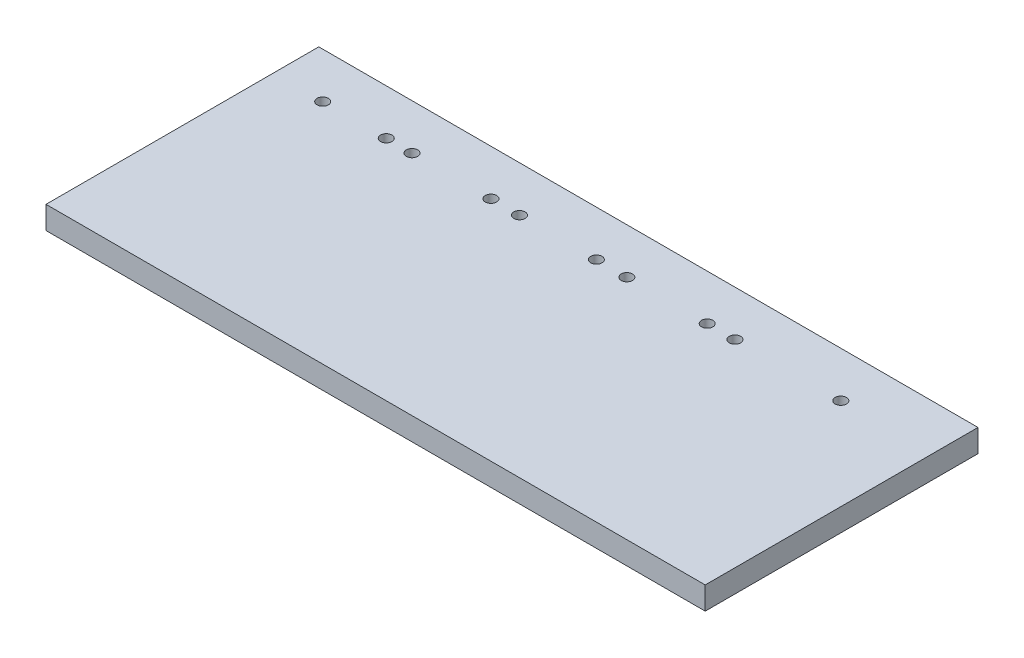
ISO-10303-21;
HEADER;
FILE_DESCRIPTION(('STEP AP214'),'2;1');
FILE_NAME('part.step','',(''),(''),'','','');
FILE_SCHEMA(('AUTOMOTIVE_DESIGN { 1 0 10303 214 1 1 1 1 }'));
ENDSEC;
DATA;
#1=APPLICATION_CONTEXT('core data for automotive mechanical design processes');
#2=APPLICATION_PROTOCOL_DEFINITION('international standard','automotive_design',2000,#1);
#3=PRODUCT_CONTEXT('',#1,'mechanical');
#4=PRODUCT('Part','Part','',(#3));
#5=PRODUCT_RELATED_PRODUCT_CATEGORY('part','',(#4));
#6=PRODUCT_DEFINITION_FORMATION('','',#4);
#7=PRODUCT_DEFINITION_CONTEXT('part definition',#1,'design');
#8=PRODUCT_DEFINITION('design','',#6,#7);
#9=PRODUCT_DEFINITION_SHAPE('','',#8);
#10=(LENGTH_UNIT() NAMED_UNIT(*) SI_UNIT(.MILLI.,.METRE.));
#11=(NAMED_UNIT(*) PLANE_ANGLE_UNIT() SI_UNIT($,.RADIAN.));
#12=(NAMED_UNIT(*) SI_UNIT($,.STERADIAN.) SOLID_ANGLE_UNIT());
#13=UNCERTAINTY_MEASURE_WITH_UNIT(LENGTH_MEASURE(1.E-05),#10,'distance_accuracy_value','');
#14=(GEOMETRIC_REPRESENTATION_CONTEXT(3) GLOBAL_UNCERTAINTY_ASSIGNED_CONTEXT((#13)) GLOBAL_UNIT_ASSIGNED_CONTEXT((#10,
#11,#12)) REPRESENTATION_CONTEXT('',''));
#15=CARTESIAN_POINT('',(0.,0.,0.));
#16=DIRECTION('',(0.,0.,1.));
#17=DIRECTION('',(1.,0.,0.));
#18=AXIS2_PLACEMENT_3D('',#15,#16,#17);
#19=CARTESIAN_POINT('',(0.,10.,0.));
#20=DIRECTION('',(1.,0.,0.));
#21=DIRECTION('',(0.,0.,-1.));
#22=AXIS2_PLACEMENT_3D('',#19,#20,#21);
#23=PLANE('',#22);
#24=DIRECTION('',(0.,0.,1.));
#25=VECTOR('',#24,1.);
#26=CARTESIAN_POINT('',(0.,0.,0.));
#27=LINE('',#26,#25);
#28=CARTESIAN_POINT('',(0.,0.,-120.));
#29=VERTEX_POINT('',#28);
#30=CARTESIAN_POINT('',(0.,0.,0.));
#31=VERTEX_POINT('',#30);
#32=EDGE_CURVE('E98',#29,#31,#27,.T.);
#33=ORIENTED_EDGE('',*,*,#32,.T.);
#34=DIRECTION('',(0.,-1.,0.));
#35=VECTOR('',#34,1.);
#36=CARTESIAN_POINT('',(0.,10.,0.));
#37=LINE('',#36,#35);
#38=CARTESIAN_POINT('',(0.,10.,0.));
#39=VERTEX_POINT('',#38);
#40=EDGE_CURVE('E11',#39,#31,#37,.T.);
#41=ORIENTED_EDGE('',*,*,#40,.F.);
#42=DIRECTION('',(0.,0.,1.));
#43=VECTOR('',#42,1.);
#44=CARTESIAN_POINT('',(0.,10.,0.));
#45=LINE('',#44,#43);
#46=CARTESIAN_POINT('',(0.,10.,-120.));
#47=VERTEX_POINT('',#46);
#48=EDGE_CURVE('E86',#47,#39,#45,.T.);
#49=ORIENTED_EDGE('',*,*,#48,.F.);
#50=DIRECTION('',(0.,-1.,0.));
#51=VECTOR('',#50,1.);
#52=CARTESIAN_POINT('',(0.,10.,-120.));
#53=LINE('',#52,#51);
#54=EDGE_CURVE('E94',#47,#29,#53,.T.);
#55=ORIENTED_EDGE('',*,*,#54,.T.);
#56=EDGE_LOOP('',(#33,#41,#49,#55));
#57=FACE_BOUND('',#56,.T.);
#58=ADVANCED_FACE('F35',(#57),#23,.F.);
#59=CARTESIAN_POINT('',(0.,10.,0.));
#60=DIRECTION('',(0.,0.,-1.));
#61=DIRECTION('',(-1.,0.,0.));
#62=AXIS2_PLACEMENT_3D('',#59,#60,#61);
#63=PLANE('',#62);
#64=DIRECTION('',(1.,0.,0.));
#65=VECTOR('',#64,1.);
#66=CARTESIAN_POINT('',(0.,0.,0.));
#67=LINE('',#66,#65);
#68=CARTESIAN_POINT('',(290.,0.,0.));
#69=VERTEX_POINT('',#68);
#70=EDGE_CURVE('E90',#31,#69,#67,.T.);
#71=ORIENTED_EDGE('',*,*,#70,.T.);
#72=DIRECTION('',(0.,-1.,0.));
#73=VECTOR('',#72,1.);
#74=CARTESIAN_POINT('',(290.,10.,0.));
#75=LINE('',#74,#73);
#76=CARTESIAN_POINT('',(290.,10.,0.));
#77=VERTEX_POINT('',#76);
#78=EDGE_CURVE('E43',#77,#69,#75,.T.);
#79=ORIENTED_EDGE('',*,*,#78,.F.);
#80=DIRECTION('',(1.,0.,0.));
#81=VECTOR('',#80,1.);
#82=CARTESIAN_POINT('',(0.,10.,0.));
#83=LINE('',#82,#81);
#84=EDGE_CURVE('E81',#39,#77,#83,.T.);
#85=ORIENTED_EDGE('',*,*,#84,.F.);
#86=ORIENTED_EDGE('',*,*,#40,.T.);
#87=EDGE_LOOP('',(#71,#79,#85,#86));
#88=FACE_BOUND('',#87,.T.);
#89=ADVANCED_FACE('F89',(#88),#63,.F.);
#90=CARTESIAN_POINT('',(290.,10.,0.));
#91=DIRECTION('',(-1.,0.,0.));
#92=DIRECTION('',(0.,0.,1.));
#93=AXIS2_PLACEMENT_3D('',#90,#91,#92);
#94=PLANE('',#93);
#95=DIRECTION('',(0.,0.,-1.));
#96=VECTOR('',#95,1.);
#97=CARTESIAN_POINT('',(290.,0.,0.));
#98=LINE('',#97,#96);
#99=CARTESIAN_POINT('',(290.,0.,-120.));
#100=VERTEX_POINT('',#99);
#101=EDGE_CURVE('E68',#69,#100,#98,.T.);
#102=ORIENTED_EDGE('',*,*,#101,.T.);
#103=DIRECTION('',(0.,-1.,0.));
#104=VECTOR('',#103,1.);
#105=CARTESIAN_POINT('',(290.,10.,-120.));
#106=LINE('',#105,#104);
#107=CARTESIAN_POINT('',(290.,10.,-120.));
#108=VERTEX_POINT('',#107);
#109=EDGE_CURVE('E91',#108,#100,#106,.T.);
#110=ORIENTED_EDGE('',*,*,#109,.F.);
#111=DIRECTION('',(0.,0.,-1.));
#112=VECTOR('',#111,1.);
#113=CARTESIAN_POINT('',(290.,10.,0.));
#114=LINE('',#113,#112);
#115=EDGE_CURVE('E84',#77,#108,#114,.T.);
#116=ORIENTED_EDGE('',*,*,#115,.F.);
#117=ORIENTED_EDGE('',*,*,#78,.T.);
#118=EDGE_LOOP('',(#102,#110,#116,#117));
#119=FACE_BOUND('',#118,.T.);
#120=ADVANCED_FACE('F92',(#119),#94,.F.);
#121=CARTESIAN_POINT('',(0.,10.,-120.));
#122=DIRECTION('',(0.,0.,1.));
#123=DIRECTION('',(1.,0.,0.));
#124=AXIS2_PLACEMENT_3D('',#121,#122,#123);
#125=PLANE('',#124);
#126=DIRECTION('',(-1.,0.,0.));
#127=VECTOR('',#126,1.);
#128=CARTESIAN_POINT('',(0.,0.,-120.));
#129=LINE('',#128,#127);
#130=EDGE_CURVE('E74',#100,#29,#129,.T.);
#131=ORIENTED_EDGE('',*,*,#130,.T.);
#132=ORIENTED_EDGE('',*,*,#54,.F.);
#133=DIRECTION('',(-1.,0.,0.));
#134=VECTOR('',#133,1.);
#135=CARTESIAN_POINT('',(0.,10.,-120.));
#136=LINE('',#135,#134);
#137=EDGE_CURVE('E51',#108,#47,#136,.T.);
#138=ORIENTED_EDGE('',*,*,#137,.F.);
#139=ORIENTED_EDGE('',*,*,#109,.T.);
#140=EDGE_LOOP('',(#131,#132,#138,#139));
#141=FACE_BOUND('',#140,.T.);
#142=ADVANCED_FACE('F106',(#141),#125,.F.);
#143=CARTESIAN_POINT('',(0.,10.,0.));
#144=DIRECTION('',(0.,-1.,0.));
#145=DIRECTION('',(0.,0.,-1.));
#146=AXIS2_PLACEMENT_3D('',#143,#144,#145);
#147=PLANE('',#146);
#148=CARTESIAN_POINT('',(249.655647953601,10.,-100.));
#149=DIRECTION('',(0.,1.,0.));
#150=DIRECTION('',(0.,0.,1.));
#151=AXIS2_PLACEMENT_3D('',#148,#149,#150);
#152=CIRCLE('',#151,2.49999999999875);
#153=CARTESIAN_POINT('',(249.655647953601,10.,-97.5000000000014));
#154=VERTEX_POINT('',#153);
#155=EDGE_CURVE('E166',#154,#154,#152,.T.);
#156=ORIENTED_EDGE('',*,*,#155,.F.);
#157=EDGE_LOOP('',(#156));
#158=FACE_BOUND('',#157,.T.);
#159=CARTESIAN_POINT('',(190.880906952669,10.,-99.9999999999958));
#160=DIRECTION('',(0.,1.,0.));
#161=DIRECTION('',(0.,0.,1.));
#162=AXIS2_PLACEMENT_3D('',#159,#160,#161);
#163=CIRCLE('',#162,2.5);
#164=CARTESIAN_POINT('',(190.880906952669,10.,-97.4999999999958));
#165=VERTEX_POINT('',#164);
#166=EDGE_CURVE('E160',#165,#165,#163,.T.);
#167=ORIENTED_EDGE('',*,*,#166,.F.);
#168=EDGE_LOOP('',(#167));
#169=FACE_BOUND('',#168,.T.);
#170=CARTESIAN_POINT('',(142.103616262742,10.,-100.));
#171=DIRECTION('',(0.,1.,0.));
#172=DIRECTION('',(0.,0.,1.));
#173=AXIS2_PLACEMENT_3D('',#170,#171,#172);
#174=CIRCLE('',#173,2.49999999999872);
#175=CARTESIAN_POINT('',(142.103616262742,10.,-97.5000000000014));
#176=VERTEX_POINT('',#175);
#177=EDGE_CURVE('E154',#176,#176,#174,.T.);
#178=ORIENTED_EDGE('',*,*,#177,.F.);
#179=EDGE_LOOP('',(#178));
#180=FACE_BOUND('',#179,.T.);
#181=CARTESIAN_POINT('',(95.7425381147304,10.,-100.));
#182=DIRECTION('',(0.,1.,0.));
#183=DIRECTION('',(0.,0.,1.));
#184=AXIS2_PLACEMENT_3D('',#181,#182,#183);
#185=CIRCLE('',#184,2.49999999999873);
#186=CARTESIAN_POINT('',(95.7425381147304,10.,-97.5000000000014));
#187=VERTEX_POINT('',#186);
#188=EDGE_CURVE('E148',#187,#187,#185,.T.);
#189=ORIENTED_EDGE('',*,*,#188,.F.);
#190=EDGE_LOOP('',(#189));
#191=FACE_BOUND('',#190,.T.);
#192=CARTESIAN_POINT('',(49.6834865344586,10.,-100.));
#193=DIRECTION('',(0.,1.,0.));
#194=DIRECTION('',(0.,0.,1.));
#195=AXIS2_PLACEMENT_3D('',#192,#193,#194);
#196=CIRCLE('',#195,2.49999999999873);
#197=CARTESIAN_POINT('',(49.6834865344586,10.,-97.5000000000014));
#198=VERTEX_POINT('',#197);
#199=EDGE_CURVE('E142',#198,#198,#196,.T.);
#200=ORIENTED_EDGE('',*,*,#199,.F.);
#201=EDGE_LOOP('',(#200));
#202=FACE_BOUND('',#201,.T.);
#203=CARTESIAN_POINT('',(21.7290329169177,10.,-100.));
#204=DIRECTION('',(0.,1.,0.));
#205=DIRECTION('',(0.,0.,1.));
#206=AXIS2_PLACEMENT_3D('',#203,#204,#205);
#207=CIRCLE('',#206,2.49999999999873);
#208=CARTESIAN_POINT('',(21.7290329169177,10.,-97.5000000000014));
#209=VERTEX_POINT('',#208);
#210=EDGE_CURVE('E136',#209,#209,#207,.T.);
#211=ORIENTED_EDGE('',*,*,#210,.F.);
#212=EDGE_LOOP('',(#211));
#213=FACE_BOUND('',#212,.T.);
#214=CARTESIAN_POINT('',(61.0094828246894,10.,-100.));
#215=DIRECTION('',(0.,1.,0.));
#216=DIRECTION('',(0.,0.,1.));
#217=AXIS2_PLACEMENT_3D('',#214,#215,#216);
#218=CIRCLE('',#217,2.49999999999873);
#219=CARTESIAN_POINT('',(61.0094828246894,10.,-97.5000000000014));
#220=VERTEX_POINT('',#219);
#221=EDGE_CURVE('E130',#220,#220,#218,.T.);
#222=ORIENTED_EDGE('',*,*,#221,.F.);
#223=EDGE_LOOP('',(#222));
#224=FACE_BOUND('',#223,.T.);
#225=CARTESIAN_POINT('',(108.276640675919,10.,-100.));
#226=DIRECTION('',(0.,1.,0.));
#227=DIRECTION('',(0.,0.,1.));
#228=AXIS2_PLACEMENT_3D('',#225,#226,#227);
#229=CIRCLE('',#228,2.49999999999873);
#230=CARTESIAN_POINT('',(108.276640675919,10.,-97.5000000000014));
#231=VERTEX_POINT('',#230);
#232=EDGE_CURVE('E124',#231,#231,#229,.T.);
#233=ORIENTED_EDGE('',*,*,#232,.F.);
#234=EDGE_LOOP('',(#233));
#235=FACE_BOUND('',#234,.T.);
#236=CARTESIAN_POINT('',(155.543798527149,10.,-100.));
#237=DIRECTION('',(0.,1.,0.));
#238=DIRECTION('',(0.,0.,1.));
#239=AXIS2_PLACEMENT_3D('',#236,#237,#238);
#240=CIRCLE('',#239,2.49999999999872);
#241=CARTESIAN_POINT('',(155.543798527149,10.,-97.5000000000014));
#242=VERTEX_POINT('',#241);
#243=EDGE_CURVE('E118',#242,#242,#240,.T.);
#244=ORIENTED_EDGE('',*,*,#243,.F.);
#245=EDGE_LOOP('',(#244));
#246=FACE_BOUND('',#245,.T.);
#247=CARTESIAN_POINT('',(203.059493974526,10.,-100.));
#248=DIRECTION('',(0.,1.,0.));
#249=DIRECTION('',(0.,0.,1.));
#250=AXIS2_PLACEMENT_3D('',#247,#248,#249);
#251=CIRCLE('',#250,2.49999999999873);
#252=CARTESIAN_POINT('',(203.059493974526,10.,-97.5000000000014));
#253=VERTEX_POINT('',#252);
#254=EDGE_CURVE('E112',#253,#253,#251,.T.);
#255=ORIENTED_EDGE('',*,*,#254,.F.);
#256=EDGE_LOOP('',(#255));
#257=FACE_BOUND('',#256,.T.);
#258=ORIENTED_EDGE('',*,*,#48,.T.);
#259=ORIENTED_EDGE('',*,*,#84,.T.);
#260=ORIENTED_EDGE('',*,*,#115,.T.);
#261=ORIENTED_EDGE('',*,*,#137,.T.);
#262=EDGE_LOOP('',(#258,#259,#260,#261));
#263=FACE_BOUND('',#262,.T.);
#264=ADVANCED_FACE('F82',(#158,#169,#180,#191,#202,#213,#224,#235,#246,#257,#263),#147,.F.);
#265=CARTESIAN_POINT('',(0.,0.,0.));
#266=DIRECTION('',(0.,-1.,0.));
#267=DIRECTION('',(0.,0.,-1.));
#268=AXIS2_PLACEMENT_3D('',#265,#266,#267);
#269=PLANE('',#268);
#270=CARTESIAN_POINT('',(249.655647953601,0.,-100.));
#271=DIRECTION('',(0.,1.,0.));
#272=DIRECTION('',(0.,0.,1.));
#273=AXIS2_PLACEMENT_3D('',#270,#271,#272);
#274=CIRCLE('',#273,2.49999999999875);
#275=CARTESIAN_POINT('',(249.655647953601,0.,-97.5000000000014));
#276=VERTEX_POINT('',#275);
#277=EDGE_CURVE('E163',#276,#276,#274,.T.);
#278=ORIENTED_EDGE('',*,*,#277,.T.);
#279=EDGE_LOOP('',(#278));
#280=FACE_BOUND('',#279,.T.);
#281=CARTESIAN_POINT('',(190.880906952669,0.,-99.9999999999958));
#282=DIRECTION('',(0.,1.,0.));
#283=DIRECTION('',(0.,0.,1.));
#284=AXIS2_PLACEMENT_3D('',#281,#282,#283);
#285=CIRCLE('',#284,2.5);
#286=CARTESIAN_POINT('',(190.880906952669,0.,-97.4999999999958));
#287=VERTEX_POINT('',#286);
#288=EDGE_CURVE('E157',#287,#287,#285,.T.);
#289=ORIENTED_EDGE('',*,*,#288,.T.);
#290=EDGE_LOOP('',(#289));
#291=FACE_BOUND('',#290,.T.);
#292=CARTESIAN_POINT('',(142.103616262742,0.,-100.));
#293=DIRECTION('',(0.,1.,0.));
#294=DIRECTION('',(0.,0.,1.));
#295=AXIS2_PLACEMENT_3D('',#292,#293,#294);
#296=CIRCLE('',#295,2.49999999999872);
#297=CARTESIAN_POINT('',(142.103616262742,0.,-97.5000000000014));
#298=VERTEX_POINT('',#297);
#299=EDGE_CURVE('E151',#298,#298,#296,.T.);
#300=ORIENTED_EDGE('',*,*,#299,.T.);
#301=EDGE_LOOP('',(#300));
#302=FACE_BOUND('',#301,.T.);
#303=CARTESIAN_POINT('',(95.7425381147304,0.,-100.));
#304=DIRECTION('',(0.,1.,0.));
#305=DIRECTION('',(0.,0.,1.));
#306=AXIS2_PLACEMENT_3D('',#303,#304,#305);
#307=CIRCLE('',#306,2.49999999999873);
#308=CARTESIAN_POINT('',(95.7425381147304,0.,-97.5000000000014));
#309=VERTEX_POINT('',#308);
#310=EDGE_CURVE('E145',#309,#309,#307,.T.);
#311=ORIENTED_EDGE('',*,*,#310,.T.);
#312=EDGE_LOOP('',(#311));
#313=FACE_BOUND('',#312,.T.);
#314=CARTESIAN_POINT('',(49.6834865344586,0.,-100.));
#315=DIRECTION('',(0.,1.,0.));
#316=DIRECTION('',(0.,0.,1.));
#317=AXIS2_PLACEMENT_3D('',#314,#315,#316);
#318=CIRCLE('',#317,2.49999999999873);
#319=CARTESIAN_POINT('',(49.6834865344586,0.,-97.5000000000014));
#320=VERTEX_POINT('',#319);
#321=EDGE_CURVE('E139',#320,#320,#318,.T.);
#322=ORIENTED_EDGE('',*,*,#321,.T.);
#323=EDGE_LOOP('',(#322));
#324=FACE_BOUND('',#323,.T.);
#325=CARTESIAN_POINT('',(21.7290329169177,0.,-100.));
#326=DIRECTION('',(0.,1.,0.));
#327=DIRECTION('',(0.,0.,1.));
#328=AXIS2_PLACEMENT_3D('',#325,#326,#327);
#329=CIRCLE('',#328,2.49999999999873);
#330=CARTESIAN_POINT('',(21.7290329169177,0.,-97.5000000000014));
#331=VERTEX_POINT('',#330);
#332=EDGE_CURVE('E133',#331,#331,#329,.T.);
#333=ORIENTED_EDGE('',*,*,#332,.T.);
#334=EDGE_LOOP('',(#333));
#335=FACE_BOUND('',#334,.T.);
#336=CARTESIAN_POINT('',(61.0094828246894,0.,-100.));
#337=DIRECTION('',(0.,1.,0.));
#338=DIRECTION('',(0.,0.,1.));
#339=AXIS2_PLACEMENT_3D('',#336,#337,#338);
#340=CIRCLE('',#339,2.49999999999873);
#341=CARTESIAN_POINT('',(61.0094828246894,0.,-97.5000000000014));
#342=VERTEX_POINT('',#341);
#343=EDGE_CURVE('E127',#342,#342,#340,.T.);
#344=ORIENTED_EDGE('',*,*,#343,.T.);
#345=EDGE_LOOP('',(#344));
#346=FACE_BOUND('',#345,.T.);
#347=CARTESIAN_POINT('',(108.276640675919,0.,-100.));
#348=DIRECTION('',(0.,1.,0.));
#349=DIRECTION('',(0.,0.,1.));
#350=AXIS2_PLACEMENT_3D('',#347,#348,#349);
#351=CIRCLE('',#350,2.49999999999873);
#352=CARTESIAN_POINT('',(108.276640675919,0.,-97.5000000000014));
#353=VERTEX_POINT('',#352);
#354=EDGE_CURVE('E121',#353,#353,#351,.T.);
#355=ORIENTED_EDGE('',*,*,#354,.T.);
#356=EDGE_LOOP('',(#355));
#357=FACE_BOUND('',#356,.T.);
#358=CARTESIAN_POINT('',(155.543798527149,0.,-100.));
#359=DIRECTION('',(0.,1.,0.));
#360=DIRECTION('',(0.,0.,1.));
#361=AXIS2_PLACEMENT_3D('',#358,#359,#360);
#362=CIRCLE('',#361,2.49999999999872);
#363=CARTESIAN_POINT('',(155.543798527149,0.,-97.5000000000014));
#364=VERTEX_POINT('',#363);
#365=EDGE_CURVE('E115',#364,#364,#362,.T.);
#366=ORIENTED_EDGE('',*,*,#365,.T.);
#367=EDGE_LOOP('',(#366));
#368=FACE_BOUND('',#367,.T.);
#369=CARTESIAN_POINT('',(203.059493974526,0.,-100.));
#370=DIRECTION('',(0.,1.,0.));
#371=DIRECTION('',(0.,0.,1.));
#372=AXIS2_PLACEMENT_3D('',#369,#370,#371);
#373=CIRCLE('',#372,2.49999999999873);
#374=CARTESIAN_POINT('',(203.059493974526,0.,-97.5000000000014));
#375=VERTEX_POINT('',#374);
#376=EDGE_CURVE('E101',#375,#375,#373,.T.);
#377=ORIENTED_EDGE('',*,*,#376,.T.);
#378=EDGE_LOOP('',(#377));
#379=FACE_BOUND('',#378,.T.);
#380=ORIENTED_EDGE('',*,*,#32,.F.);
#381=ORIENTED_EDGE('',*,*,#130,.F.);
#382=ORIENTED_EDGE('',*,*,#101,.F.);
#383=ORIENTED_EDGE('',*,*,#70,.F.);
#384=EDGE_LOOP('',(#380,#381,#382,#383));
#385=FACE_BOUND('',#384,.T.);
#386=ADVANCED_FACE('F109',(#280,#291,#302,#313,#324,#335,#346,#357,#368,#379,#385),#269,.T.);
#387=CARTESIAN_POINT('',(203.059493974526,0.,-100.));
#388=DIRECTION('',(0.,1.,0.));
#389=DIRECTION('',(0.,0.,1.));
#390=AXIS2_PLACEMENT_3D('',#387,#388,#389);
#391=CYLINDRICAL_SURFACE('',#390,2.49999999999873);
#392=ORIENTED_EDGE('',*,*,#376,.F.);
#393=EDGE_LOOP('',(#392));
#394=FACE_BOUND('',#393,.T.);
#395=ORIENTED_EDGE('',*,*,#254,.T.);
#396=EDGE_LOOP('',(#395));
#397=FACE_BOUND('',#396,.T.);
#398=ADVANCED_FACE('F202',(#394,#397),#391,.F.);
#399=CARTESIAN_POINT('',(155.543798527149,0.,-100.));
#400=DIRECTION('',(0.,1.,0.));
#401=DIRECTION('',(0.,0.,1.));
#402=AXIS2_PLACEMENT_3D('',#399,#400,#401);
#403=CYLINDRICAL_SURFACE('',#402,2.49999999999872);
#404=ORIENTED_EDGE('',*,*,#365,.F.);
#405=EDGE_LOOP('',(#404));
#406=FACE_BOUND('',#405,.T.);
#407=ORIENTED_EDGE('',*,*,#243,.T.);
#408=EDGE_LOOP('',(#407));
#409=FACE_BOUND('',#408,.T.);
#410=ADVANCED_FACE('F204',(#406,#409),#403,.F.);
#411=CARTESIAN_POINT('',(108.276640675919,0.,-100.));
#412=DIRECTION('',(0.,1.,0.));
#413=DIRECTION('',(0.,0.,1.));
#414=AXIS2_PLACEMENT_3D('',#411,#412,#413);
#415=CYLINDRICAL_SURFACE('',#414,2.49999999999873);
#416=ORIENTED_EDGE('',*,*,#354,.F.);
#417=EDGE_LOOP('',(#416));
#418=FACE_BOUND('',#417,.T.);
#419=ORIENTED_EDGE('',*,*,#232,.T.);
#420=EDGE_LOOP('',(#419));
#421=FACE_BOUND('',#420,.T.);
#422=ADVANCED_FACE('F211',(#418,#421),#415,.F.);
#423=CARTESIAN_POINT('',(61.0094828246894,0.,-100.));
#424=DIRECTION('',(0.,1.,0.));
#425=DIRECTION('',(0.,0.,1.));
#426=AXIS2_PLACEMENT_3D('',#423,#424,#425);
#427=CYLINDRICAL_SURFACE('',#426,2.49999999999873);
#428=ORIENTED_EDGE('',*,*,#343,.F.);
#429=EDGE_LOOP('',(#428));
#430=FACE_BOUND('',#429,.T.);
#431=ORIENTED_EDGE('',*,*,#221,.T.);
#432=EDGE_LOOP('',(#431));
#433=FACE_BOUND('',#432,.T.);
#434=ADVANCED_FACE('F257',(#430,#433),#427,.F.);
#435=CARTESIAN_POINT('',(21.7290329169177,0.,-100.));
#436=DIRECTION('',(0.,1.,0.));
#437=DIRECTION('',(0.,0.,1.));
#438=AXIS2_PLACEMENT_3D('',#435,#436,#437);
#439=CYLINDRICAL_SURFACE('',#438,2.49999999999873);
#440=ORIENTED_EDGE('',*,*,#332,.F.);
#441=EDGE_LOOP('',(#440));
#442=FACE_BOUND('',#441,.T.);
#443=ORIENTED_EDGE('',*,*,#210,.T.);
#444=EDGE_LOOP('',(#443));
#445=FACE_BOUND('',#444,.T.);
#446=ADVANCED_FACE('F267',(#442,#445),#439,.F.);
#447=CARTESIAN_POINT('',(49.6834865344586,0.,-100.));
#448=DIRECTION('',(0.,1.,0.));
#449=DIRECTION('',(0.,0.,1.));
#450=AXIS2_PLACEMENT_3D('',#447,#448,#449);
#451=CYLINDRICAL_SURFACE('',#450,2.49999999999873);
#452=ORIENTED_EDGE('',*,*,#321,.F.);
#453=EDGE_LOOP('',(#452));
#454=FACE_BOUND('',#453,.T.);
#455=ORIENTED_EDGE('',*,*,#199,.T.);
#456=EDGE_LOOP('',(#455));
#457=FACE_BOUND('',#456,.T.);
#458=ADVANCED_FACE('F277',(#454,#457),#451,.F.);
#459=CARTESIAN_POINT('',(95.7425381147304,0.,-100.));
#460=DIRECTION('',(0.,1.,0.));
#461=DIRECTION('',(0.,0.,1.));
#462=AXIS2_PLACEMENT_3D('',#459,#460,#461);
#463=CYLINDRICAL_SURFACE('',#462,2.49999999999873);
#464=ORIENTED_EDGE('',*,*,#310,.F.);
#465=EDGE_LOOP('',(#464));
#466=FACE_BOUND('',#465,.T.);
#467=ORIENTED_EDGE('',*,*,#188,.T.);
#468=EDGE_LOOP('',(#467));
#469=FACE_BOUND('',#468,.T.);
#470=ADVANCED_FACE('F287',(#466,#469),#463,.F.);
#471=CARTESIAN_POINT('',(142.103616262742,0.,-100.));
#472=DIRECTION('',(0.,1.,0.));
#473=DIRECTION('',(0.,0.,1.));
#474=AXIS2_PLACEMENT_3D('',#471,#472,#473);
#475=CYLINDRICAL_SURFACE('',#474,2.49999999999872);
#476=ORIENTED_EDGE('',*,*,#299,.F.);
#477=EDGE_LOOP('',(#476));
#478=FACE_BOUND('',#477,.T.);
#479=ORIENTED_EDGE('',*,*,#177,.T.);
#480=EDGE_LOOP('',(#479));
#481=FACE_BOUND('',#480,.T.);
#482=ADVANCED_FACE('F297',(#478,#481),#475,.F.);
#483=CARTESIAN_POINT('',(190.880906952669,0.,-99.9999999999958));
#484=DIRECTION('',(0.,1.,0.));
#485=DIRECTION('',(0.,0.,1.));
#486=AXIS2_PLACEMENT_3D('',#483,#484,#485);
#487=CYLINDRICAL_SURFACE('',#486,2.5);
#488=ORIENTED_EDGE('',*,*,#288,.F.);
#489=EDGE_LOOP('',(#488));
#490=FACE_BOUND('',#489,.T.);
#491=ORIENTED_EDGE('',*,*,#166,.T.);
#492=EDGE_LOOP('',(#491));
#493=FACE_BOUND('',#492,.T.);
#494=ADVANCED_FACE('F177',(#490,#493),#487,.F.);
#495=CARTESIAN_POINT('',(249.655647953601,0.,-100.));
#496=DIRECTION('',(0.,1.,0.));
#497=DIRECTION('',(0.,0.,1.));
#498=AXIS2_PLACEMENT_3D('',#495,#496,#497);
#499=CYLINDRICAL_SURFACE('',#498,2.49999999999875);
#500=ORIENTED_EDGE('',*,*,#277,.F.);
#501=EDGE_LOOP('',(#500));
#502=FACE_BOUND('',#501,.T.);
#503=ORIENTED_EDGE('',*,*,#155,.T.);
#504=EDGE_LOOP('',(#503));
#505=FACE_BOUND('',#504,.T.);
#506=ADVANCED_FACE('F174',(#502,#505),#499,.F.);
#507=CLOSED_SHELL('',(#58,#89,#120,#142,#264,#386,#398,#410,#422,#434,#446,#458,#470,#482,#494,#506));
#508=MANIFOLD_SOLID_BREP('B2',#507);
#509=ADVANCED_BREP_SHAPE_REPRESENTATION('',(#18,#508),#14);
#510=SHAPE_DEFINITION_REPRESENTATION(#9,#509);
ENDSEC;
END-ISO-10303-21;
